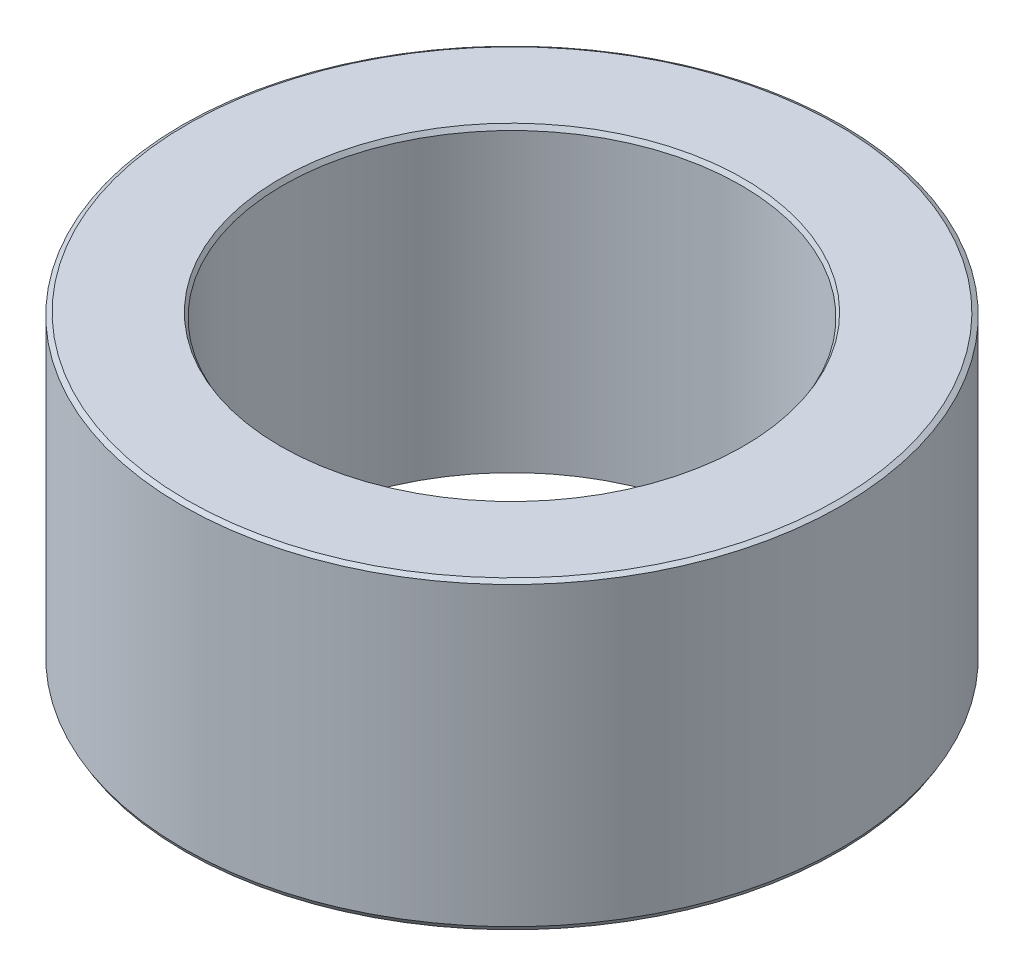
ISO-10303-21;
HEADER;
FILE_DESCRIPTION(('STEP AP214'),'2;1');
FILE_NAME('part.step','',(''),(''),'','','');
FILE_SCHEMA(('AUTOMOTIVE_DESIGN { 1 0 10303 214 1 1 1 1 }'));
ENDSEC;
DATA;
#1=APPLICATION_CONTEXT('core data for automotive mechanical design processes');
#2=APPLICATION_PROTOCOL_DEFINITION('international standard','automotive_design',2000,#1);
#3=PRODUCT_CONTEXT('',#1,'mechanical');
#4=PRODUCT('Part','Part','',(#3));
#5=PRODUCT_RELATED_PRODUCT_CATEGORY('part','',(#4));
#6=PRODUCT_DEFINITION_FORMATION('','',#4);
#7=PRODUCT_DEFINITION_CONTEXT('part definition',#1,'design');
#8=PRODUCT_DEFINITION('design','',#6,#7);
#9=PRODUCT_DEFINITION_SHAPE('','',#8);
#10=(LENGTH_UNIT() NAMED_UNIT(*) SI_UNIT(.MILLI.,.METRE.));
#11=(NAMED_UNIT(*) PLANE_ANGLE_UNIT() SI_UNIT($,.RADIAN.));
#12=(NAMED_UNIT(*) SI_UNIT($,.STERADIAN.) SOLID_ANGLE_UNIT());
#13=UNCERTAINTY_MEASURE_WITH_UNIT(LENGTH_MEASURE(1.E-05),#10,'distance_accuracy_value','');
#14=(GEOMETRIC_REPRESENTATION_CONTEXT(3) GLOBAL_UNCERTAINTY_ASSIGNED_CONTEXT((#13)) GLOBAL_UNIT_ASSIGNED_CONTEXT((#10,
#11,#12)) REPRESENTATION_CONTEXT('',''));
#15=CARTESIAN_POINT('',(0.,0.,0.));
#16=DIRECTION('',(0.,0.,1.));
#17=DIRECTION('',(1.,0.,0.));
#18=AXIS2_PLACEMENT_3D('',#15,#16,#17);
#19=CARTESIAN_POINT('',(0.,48.3163190801309,0.));
#20=DIRECTION('',(0.,-1.,0.));
#21=DIRECTION('',(0.,0.,-1.));
#22=AXIS2_PLACEMENT_3D('',#19,#20,#21);
#23=CYLINDRICAL_SURFACE('',#22,52.5);
#24=CARTESIAN_POINT('',(0.,0.715744627159023,0.));
#25=DIRECTION('',(0.,1.,0.));
#26=DIRECTION('',(0.,0.,1.));
#27=AXIS2_PLACEMENT_3D('',#24,#25,#26);
#28=CIRCLE('',#27,52.5);
#29=CARTESIAN_POINT('',(0.,0.715744627159023,52.5));
#30=VERTEX_POINT('',#29);
#31=EDGE_CURVE('E10',#30,#30,#28,.T.);
#32=ORIENTED_EDGE('',*,*,#31,.T.);
#33=EDGE_LOOP('',(#32));
#34=FACE_BOUND('',#33,.T.);
#35=CARTESIAN_POINT('',(0.,47.9030837269696,0.));
#36=DIRECTION('',(0.,1.,0.));
#37=DIRECTION('',(0.,0.,1.));
#38=AXIS2_PLACEMENT_3D('',#35,#36,#37);
#39=CIRCLE('',#38,52.5);
#40=CARTESIAN_POINT('',(0.,47.9030837269696,52.5));
#41=VERTEX_POINT('',#40);
#42=EDGE_CURVE('E50',#41,#41,#39,.F.);
#43=ORIENTED_EDGE('',*,*,#42,.T.);
#44=EDGE_LOOP('',(#43));
#45=FACE_BOUND('',#44,.T.);
#46=ADVANCED_FACE('F39',(#34,#45),#23,.T.);
#47=CARTESIAN_POINT('',(0.,48.3163190801309,0.));
#48=DIRECTION('',(0.,1.,0.));
#49=DIRECTION('',(0.,0.,1.));
#50=AXIS2_PLACEMENT_3D('',#47,#48,#49);
#51=PLANE('',#50);
#52=CARTESIAN_POINT('',(0.,48.3163190801309,0.));
#53=DIRECTION('',(0.,1.,0.));
#54=DIRECTION('',(0.,0.,1.));
#55=AXIS2_PLACEMENT_3D('',#52,#53,#54);
#56=CIRCLE('',#55,36.8925618320461);
#57=CARTESIAN_POINT('',(0.,48.3163190801309,36.8925618320461));
#58=VERTEX_POINT('',#57);
#59=EDGE_CURVE('E58',#58,#58,#56,.F.);
#60=ORIENTED_EDGE('',*,*,#59,.T.);
#61=EDGE_LOOP('',(#60));
#62=FACE_BOUND('',#61,.T.);
#63=CARTESIAN_POINT('',(0.,48.3163190801309,0.));
#64=DIRECTION('',(0.,1.,0.));
#65=DIRECTION('',(0.,0.,1.));
#66=AXIS2_PLACEMENT_3D('',#63,#64,#65);
#67=CIRCLE('',#66,51.784255372841);
#68=CARTESIAN_POINT('',(0.,48.3163190801309,51.784255372841));
#69=VERTEX_POINT('',#68);
#70=EDGE_CURVE('E61',#69,#69,#67,.T.);
#71=ORIENTED_EDGE('',*,*,#70,.T.);
#72=EDGE_LOOP('',(#71));
#73=FACE_BOUND('',#72,.T.);
#74=ADVANCED_FACE('F88',(#62,#73),#51,.T.);
#75=CARTESIAN_POINT('',(0.,0.,0.));
#76=DIRECTION('',(0.,1.,0.));
#77=DIRECTION('',(0.,0.,1.));
#78=AXIS2_PLACEMENT_3D('',#75,#76,#77);
#79=PLANE('',#78);
#80=CARTESIAN_POINT('',(0.,0.,0.));
#81=DIRECTION('',(0.,1.,0.));
#82=DIRECTION('',(0.,0.,1.));
#83=AXIS2_PLACEMENT_3D('',#80,#81,#82);
#84=CIRCLE('',#83,37.1950711060438);
#85=CARTESIAN_POINT('',(0.,0.,37.1950711060438));
#86=VERTEX_POINT('',#85);
#87=EDGE_CURVE('E51',#86,#86,#84,.T.);
#88=ORIENTED_EDGE('',*,*,#87,.T.);
#89=EDGE_LOOP('',(#88));
#90=FACE_BOUND('',#89,.T.);
#91=CARTESIAN_POINT('',(0.,0.,0.));
#92=DIRECTION('',(0.,1.,0.));
#93=DIRECTION('',(0.,0.,1.));
#94=AXIS2_PLACEMENT_3D('',#91,#92,#93);
#95=CIRCLE('',#94,52.0867646468387);
#96=CARTESIAN_POINT('',(0.,0.,52.0867646468387));
#97=VERTEX_POINT('',#96);
#98=EDGE_CURVE('E54',#97,#97,#95,.F.);
#99=ORIENTED_EDGE('',*,*,#98,.T.);
#100=EDGE_LOOP('',(#99));
#101=FACE_BOUND('',#100,.T.);
#102=ADVANCED_FACE('F83',(#90,#101),#79,.F.);
#103=CARTESIAN_POINT('',(0.,48.3163190801309,0.));
#104=DIRECTION('',(0.,-1.,0.));
#105=DIRECTION('',(0.,0.,-1.));
#106=AXIS2_PLACEMENT_3D('',#103,#104,#105);
#107=CYLINDRICAL_SURFACE('',#106,36.4793264788848);
#108=CARTESIAN_POINT('',(0.,47.6005744529718,0.));
#109=DIRECTION('',(0.,1.,0.));
#110=DIRECTION('',(0.,0.,1.));
#111=AXIS2_PLACEMENT_3D('',#108,#109,#110);
#112=CIRCLE('',#111,36.4793264788848);
#113=CARTESIAN_POINT('',(0.,47.6005744529718,36.4793264788848));
#114=VERTEX_POINT('',#113);
#115=EDGE_CURVE('E67',#114,#114,#112,.T.);
#116=ORIENTED_EDGE('',*,*,#115,.T.);
#117=EDGE_LOOP('',(#116));
#118=FACE_BOUND('',#117,.T.);
#119=CARTESIAN_POINT('',(0.,0.413235353161311,0.));
#120=DIRECTION('',(0.,1.,0.));
#121=DIRECTION('',(0.,0.,1.));
#122=AXIS2_PLACEMENT_3D('',#119,#120,#121);
#123=CIRCLE('',#122,36.4793264788848);
#124=CARTESIAN_POINT('',(0.,0.413235353161311,36.4793264788848));
#125=VERTEX_POINT('',#124);
#126=EDGE_CURVE('E69',#125,#125,#123,.F.);
#127=ORIENTED_EDGE('',*,*,#126,.T.);
#128=EDGE_LOOP('',(#127));
#129=FACE_BOUND('',#128,.T.);
#130=ADVANCED_FACE('F71',(#118,#129),#107,.F.);
#131=CARTESIAN_POINT('',(0.,47.6005744529718,0.));
#132=DIRECTION('',(0.,1.,0.));
#133=DIRECTION('',(0.,0.,1.));
#134=AXIS2_PLACEMENT_3D('',#131,#132,#133);
#135=CONICAL_SURFACE('',#134,36.4793264788848,0.523598775598311);
#136=CARTESIAN_POINT('',(0.,48.3163190801309,36.8925618320461));
#137=CARTESIAN_POINT('',(0.,48.3088634069313,36.8882572971173));
#138=CARTESIAN_POINT('',(0.,48.3014077337317,36.8839527621885));
#139=CARTESIAN_POINT('',(0.,48.2864963873326,36.875343692331));
#140=CARTESIAN_POINT('',(0.,48.279040714133,36.8710391574022));
#141=CARTESIAN_POINT('',(0.,48.2641293677338,36.8624300875447));
#142=CARTESIAN_POINT('',(0.,48.2566736945343,36.858125552616));
#143=CARTESIAN_POINT('',(0.,48.2417623481351,36.8495164827584));
#144=CARTESIAN_POINT('',(0.,48.2343066749356,36.8452119478297));
#145=CARTESIAN_POINT('',(0.,48.2193953285364,36.8366028779721));
#146=CARTESIAN_POINT('',(0.,48.2119396553368,36.8322983430434));
#147=CARTESIAN_POINT('',(0.,48.1970283089377,36.8236892731858));
#148=CARTESIAN_POINT('',(0.,48.1895726357381,36.8193847382571));
#149=CARTESIAN_POINT('',(0.,48.174661289339,36.8107756683996));
#150=CARTESIAN_POINT('',(0.,48.1672056161394,36.8064711334708));
#151=CARTESIAN_POINT('',(0.,48.1522942697402,36.7978620636133));
#152=CARTESIAN_POINT('',(0.,48.1448385965407,36.7935575286845));
#153=CARTESIAN_POINT('',(0.,48.1299272501415,36.784948458827));
#154=CARTESIAN_POINT('',(0.,48.1224715769419,36.7806439238982));
#155=CARTESIAN_POINT('',(0.,48.1075602305428,36.7720348540407));
#156=CARTESIAN_POINT('',(0.,48.1001045573432,36.7677303191119));
#157=CARTESIAN_POINT('',(0.,48.0851932109441,36.7591212492544));
#158=CARTESIAN_POINT('',(0.,48.0777375377445,36.7548167143256));
#159=CARTESIAN_POINT('',(0.,48.0628261913454,36.7462076444681));
#160=CARTESIAN_POINT('',(0.,48.0553705181458,36.7419031095393));
#161=CARTESIAN_POINT('',(0.,48.0404591717466,36.7332940396818));
#162=CARTESIAN_POINT('',(0.,48.0330034985471,36.728989504753));
#163=CARTESIAN_POINT('',(0.,48.0180921521479,36.7203804348955));
#164=CARTESIAN_POINT('',(0.,48.0106364789483,36.7160758999667));
#165=CARTESIAN_POINT('',(0.,47.9957251325492,36.7074668301092));
#166=CARTESIAN_POINT('',(0.,47.9882694593496,36.7031622951805));
#167=CARTESIAN_POINT('',(0.,47.9733581129505,36.6945532253229));
#168=CARTESIAN_POINT('',(0.,47.9659024397509,36.6902486903942));
#169=CARTESIAN_POINT('',(0.,47.9509910933518,36.6816396205366));
#170=CARTESIAN_POINT('',(0.,47.9435354201522,36.6773350856079));
#171=CARTESIAN_POINT('',(0.,47.928624073753,36.6687260157504));
#172=CARTESIAN_POINT('',(0.,47.9211684005535,36.6644214808216));
#173=CARTESIAN_POINT('',(0.,47.9062570541543,36.6558124109641));
#174=CARTESIAN_POINT('',(0.,47.8988013809548,36.6515078760353));
#175=CARTESIAN_POINT('',(0.,47.8838900345556,36.6428988061778));
#176=CARTESIAN_POINT('',(0.,47.876434361356,36.638594271249));
#177=CARTESIAN_POINT('',(0.,47.8615230149569,36.6299852013915));
#178=CARTESIAN_POINT('',(0.,47.8540673417573,36.6256806664627));
#179=CARTESIAN_POINT('',(0.,47.8391559953582,36.6170715966052));
#180=CARTESIAN_POINT('',(0.,47.8317003221586,36.6127670616764));
#181=CARTESIAN_POINT('',(0.,47.8167889757594,36.6041579918189));
#182=CARTESIAN_POINT('',(0.,47.8093333025599,36.5998534568901));
#183=CARTESIAN_POINT('',(0.,47.7944219561607,36.5912443870326));
#184=CARTESIAN_POINT('',(0.,47.7869662829611,36.5869398521038));
#185=CARTESIAN_POINT('',(0.,47.772054936562,36.5783307822463));
#186=CARTESIAN_POINT('',(0.,47.7645992633624,36.5740262473175));
#187=CARTESIAN_POINT('',(0.,47.7496879169633,36.56541717746));
#188=CARTESIAN_POINT('',(0.,47.7422322437637,36.5611126425313));
#189=CARTESIAN_POINT('',(0.,47.7273208973646,36.5525035726737));
#190=CARTESIAN_POINT('',(0.,47.719865224165,36.548199037745));
#191=CARTESIAN_POINT('',(0.,47.7049538777658,36.5395899678874));
#192=CARTESIAN_POINT('',(0.,47.6974982045663,36.5352854329587));
#193=CARTESIAN_POINT('',(0.,47.6825868581671,36.5266763631011));
#194=CARTESIAN_POINT('',(0.,47.6751311849675,36.5223718281724));
#195=CARTESIAN_POINT('',(0.,47.6602198385684,36.5137627583149));
#196=CARTESIAN_POINT('',(0.,47.6527641653688,36.5094582233861));
#197=CARTESIAN_POINT('',(0.,47.6378528189697,36.5008491535286));
#198=CARTESIAN_POINT('',(0.,47.6303971457701,36.4965446185998));
#199=CARTESIAN_POINT('',(0.,47.615485799371,36.4879355487423));
#200=CARTESIAN_POINT('',(0.,47.6080301261714,36.4836310138135));
#201=CARTESIAN_POINT('',(0.,47.6005744529718,36.4793264788848));
#202=B_SPLINE_CURVE_WITH_KNOTS('',3,(#136,#137,#138,#139,#140,#141,#142,#143,#144,#145,#146,
#147,#148,#149,#150,#151,#152,#153,#154,#155,#156,#157,#158,#159,#160,#161,#162,#163,#164,#165,
#166,#167,#168,#169,#170,#171,#172,#173,#174,#175,#176,#177,#178,#179,#180,#181,#182,#183,#184,
#185,#186,#187,#188,#189,#190,#191,#192,#193,#194,#195,#196,#197,#198,#199,#200,#201),
.UNSPECIFIED.,.F.,.F.,(4,2,2,2,2,2,2,2,2,2,2,2,2,2,2,2,2,2,2,2,2,2,2,2,2,2,2,2,2,2,2,2,4),(0.,
0.0258272095725775,0.0516544191451575,0.077481628717741,0.103308838290325,0.129136047862905,
0.154963257435488,0.180790467008068,0.206617676580652,0.232444886153229,0.258272095725809,
0.284099305298393,0.309926514870973,0.335753724443556,0.36158093401614,0.38740814358872,
0.413235353161303,0.439062562733877,0.464889772306461,0.490716981879044,0.516544191451624,
0.542371401024208,0.568198610596788,0.594025820169371,0.619853029741955,0.645680239314529,
0.671507448887112,0.697334658459693,0.723161868032276,0.74898907760486,0.77481628717744,
0.800643496750023,0.826470706322597),.UNSPECIFIED.);
#203=EDGE_CURVE('BSEAM77',#58,#114,#202,.T.);
#204=ORIENTED_EDGE('',*,*,#59,.F.);
#205=ORIENTED_EDGE('',*,*,#115,.F.);
#206=ORIENTED_EDGE('',*,*,#203,.T.);
#207=ORIENTED_EDGE('',*,*,#203,.F.);
#208=EDGE_LOOP('',(#204,#206,#205,#207));
#209=FACE_BOUND('',#208,.T.);
#210=ADVANCED_FACE('F77',(#209),#135,.F.);
#211=CARTESIAN_POINT('',(0.,0.,0.));
#212=DIRECTION('',(0.,-1.,0.));
#213=DIRECTION('',(0.,0.,-1.));
#214=AXIS2_PLACEMENT_3D('',#211,#212,#213);
#215=CONICAL_SURFACE('',#214,37.1950711060438,1.0471975511966);
#216=ORIENTED_EDGE('',*,*,#126,.F.);
#217=EDGE_LOOP('',(#216));
#218=FACE_BOUND('',#217,.T.);
#219=ORIENTED_EDGE('',*,*,#87,.F.);
#220=EDGE_LOOP('',(#219));
#221=FACE_BOUND('',#220,.T.);
#222=ADVANCED_FACE('F73',(#218,#221),#215,.F.);
#223=CARTESIAN_POINT('',(0.,0.715744627159023,0.));
#224=DIRECTION('',(0.,1.,0.));
#225=DIRECTION('',(0.,0.,1.));
#226=AXIS2_PLACEMENT_3D('',#223,#224,#225);
#227=CONICAL_SURFACE('',#226,52.5,0.523598775598298);
#228=ORIENTED_EDGE('',*,*,#98,.F.);
#229=EDGE_LOOP('',(#228));
#230=FACE_BOUND('',#229,.T.);
#231=ORIENTED_EDGE('',*,*,#31,.F.);
#232=EDGE_LOOP('',(#231));
#233=FACE_BOUND('',#232,.T.);
#234=ADVANCED_FACE('F76',(#230,#233),#227,.T.);
#235=CARTESIAN_POINT('',(0.,48.3163190801309,0.));
#236=DIRECTION('',(0.,-1.,0.));
#237=DIRECTION('',(0.,0.,-1.));
#238=AXIS2_PLACEMENT_3D('',#235,#236,#237);
#239=CONICAL_SURFACE('',#238,51.784255372841,1.04719755119659);
#240=ORIENTED_EDGE('',*,*,#42,.F.);
#241=EDGE_LOOP('',(#240));
#242=FACE_BOUND('',#241,.T.);
#243=ORIENTED_EDGE('',*,*,#70,.F.);
#244=EDGE_LOOP('',(#243));
#245=FACE_BOUND('',#244,.T.);
#246=ADVANCED_FACE('F45',(#242,#245),#239,.T.);
#247=CLOSED_SHELL('',(#46,#74,#102,#130,#210,#222,#234,#246));
#248=MANIFOLD_SOLID_BREP('B2',#247);
#249=ADVANCED_BREP_SHAPE_REPRESENTATION('',(#18,#248),#14);
#250=SHAPE_DEFINITION_REPRESENTATION(#9,#249);
ENDSEC;
END-ISO-10303-21;
